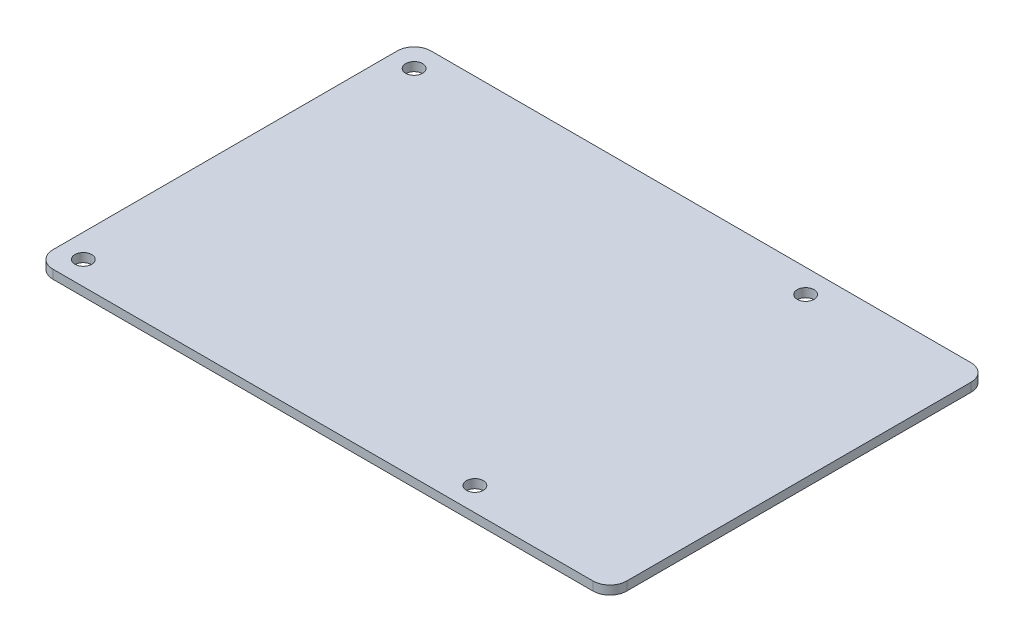
ISO-10303-21;
HEADER;
FILE_DESCRIPTION(('STEP AP214'),'2;1');
FILE_NAME('part.step','',(''),(''),'','','');
FILE_SCHEMA(('AUTOMOTIVE_DESIGN { 1 0 10303 214 1 1 1 1 }'));
ENDSEC;
DATA;
#1=APPLICATION_CONTEXT('core data for automotive mechanical design processes');
#2=APPLICATION_PROTOCOL_DEFINITION('international standard','automotive_design',2000,#1);
#3=PRODUCT_CONTEXT('',#1,'mechanical');
#4=PRODUCT('Part','Part','',(#3));
#5=PRODUCT_RELATED_PRODUCT_CATEGORY('part','',(#4));
#6=PRODUCT_DEFINITION_FORMATION('','',#4);
#7=PRODUCT_DEFINITION_CONTEXT('part definition',#1,'design');
#8=PRODUCT_DEFINITION('design','',#6,#7);
#9=PRODUCT_DEFINITION_SHAPE('','',#8);
#10=(LENGTH_UNIT() NAMED_UNIT(*) SI_UNIT(.MILLI.,.METRE.));
#11=(NAMED_UNIT(*) PLANE_ANGLE_UNIT() SI_UNIT($,.RADIAN.));
#12=(NAMED_UNIT(*) SI_UNIT($,.STERADIAN.) SOLID_ANGLE_UNIT());
#13=UNCERTAINTY_MEASURE_WITH_UNIT(LENGTH_MEASURE(1.E-05),#10,'distance_accuracy_value','');
#14=(GEOMETRIC_REPRESENTATION_CONTEXT(3) GLOBAL_UNCERTAINTY_ASSIGNED_CONTEXT((#13)) GLOBAL_UNIT_ASSIGNED_CONTEXT((#10,
#11,#12)) REPRESENTATION_CONTEXT('',''));
#15=CARTESIAN_POINT('',(0.,0.,0.));
#16=DIRECTION('',(0.,0.,1.));
#17=DIRECTION('',(1.,0.,0.));
#18=AXIS2_PLACEMENT_3D('',#15,#16,#17);
#19=CARTESIAN_POINT('',(39.9999999999725,0.,25.5000000000432));
#20=DIRECTION('',(0.,1.,0.));
#21=DIRECTION('',(0.,0.,1.));
#22=AXIS2_PLACEMENT_3D('',#19,#20,#21);
#23=PLANE('',#22);
#24=CARTESIAN_POINT('',(-40.0000000000275,0.,25.4999999999568));
#25=DIRECTION('',(0.,1.,0.));
#26=DIRECTION('',(0.,0.,1.));
#27=AXIS2_PLACEMENT_3D('',#24,#25,#26);
#28=CIRCLE('',#27,2.50000000000001);
#29=CARTESIAN_POINT('',(-40.0000000000302,0.,27.9999999999568));
#30=VERTEX_POINT('',#29);
#31=CARTESIAN_POINT('',(-42.5000000000275,0.,25.4999999999541));
#32=VERTEX_POINT('',#31);
#33=EDGE_CURVE('E144',#30,#32,#28,.F.);
#34=ORIENTED_EDGE('',*,*,#33,.F.);
#35=DIRECTION('',(1.,0.,1.07938831483967E-12));
#36=VECTOR('',#35,1.);
#37=CARTESIAN_POINT('',(-40.0000000000302,0.,27.9999999999568));
#38=LINE('',#37,#36);
#39=CARTESIAN_POINT('',(39.9999999999711,0.,28.0000000000432));
#40=VERTEX_POINT('',#39);
#41=EDGE_CURVE('E112',#40,#30,#38,.F.);
#42=ORIENTED_EDGE('',*,*,#41,.F.);
#43=CARTESIAN_POINT('',(39.9999999999725,0.,25.5000000000432));
#44=DIRECTION('',(0.,1.,0.));
#45=DIRECTION('',(0.,0.,1.));
#46=AXIS2_PLACEMENT_3D('',#43,#44,#45);
#47=CIRCLE('',#46,2.50000000000001);
#48=CARTESIAN_POINT('',(42.4999999999725,0.,25.5000000000459));
#49=VERTEX_POINT('',#48);
#50=EDGE_CURVE('E98',#49,#40,#47,.F.);
#51=ORIENTED_EDGE('',*,*,#50,.F.);
#52=DIRECTION('',(1.07920208717239E-12,0.,-1.));
#53=VECTOR('',#52,1.);
#54=CARTESIAN_POINT('',(42.4999999999725,0.,25.5000000000459));
#55=LINE('',#54,#53);
#56=CARTESIAN_POINT('',(42.5000000000275,0.,-25.4999999999541));
#57=VERTEX_POINT('',#56);
#58=EDGE_CURVE('E92',#57,#49,#55,.F.);
#59=ORIENTED_EDGE('',*,*,#58,.F.);
#60=CARTESIAN_POINT('',(40.0000000000275,0.,-25.4999999999568));
#61=DIRECTION('',(0.,1.,0.));
#62=DIRECTION('',(0.,0.,1.));
#63=AXIS2_PLACEMENT_3D('',#60,#61,#62);
#64=CIRCLE('',#63,2.5);
#65=CARTESIAN_POINT('',(40.0000000000302,0.,-27.9999999999568));
#66=VERTEX_POINT('',#65);
#67=EDGE_CURVE('E83',#66,#57,#64,.F.);
#68=ORIENTED_EDGE('',*,*,#67,.F.);
#69=DIRECTION('',(-1.,0.,-1.07908473823137E-12));
#70=VECTOR('',#69,1.);
#71=CARTESIAN_POINT('',(40.0000000000302,0.,-27.9999999999568));
#72=LINE('',#71,#70);
#73=CARTESIAN_POINT('',(-39.9999999999698,0.,-28.0000000000432));
#74=VERTEX_POINT('',#73);
#75=EDGE_CURVE('E78',#74,#66,#72,.F.);
#76=ORIENTED_EDGE('',*,*,#75,.F.);
#77=CARTESIAN_POINT('',(-39.9999999999725,0.,-25.5000000000431));
#78=DIRECTION('',(0.,1.,0.));
#79=DIRECTION('',(0.,0.,1.));
#80=AXIS2_PLACEMENT_3D('',#77,#78,#79);
#81=CIRCLE('',#80,2.5);
#82=CARTESIAN_POINT('',(-42.4999999999725,0.,-25.5000000000458));
#83=VERTEX_POINT('',#82);
#84=EDGE_CURVE('E146',#83,#74,#81,.F.);
#85=ORIENTED_EDGE('',*,*,#84,.F.);
#86=DIRECTION('',(-1.07933814391561E-12,0.,1.));
#87=VECTOR('',#86,1.);
#88=CARTESIAN_POINT('',(-42.4999999999725,0.,-25.5000000000458));
#89=LINE('',#88,#87);
#90=EDGE_CURVE('E116',#32,#83,#89,.F.);
#91=ORIENTED_EDGE('',*,*,#90,.F.);
#92=EDGE_LOOP('',(#34,#42,#51,#59,#68,#76,#85,#91));
#93=FACE_BOUND('',#92,.T.);
#94=CARTESIAN_POINT('',(19.000000000013,0.,-24.499999999993));
#95=DIRECTION('',(0.,1.,0.));
#96=DIRECTION('',(0.,0.,1.));
#97=AXIS2_PLACEMENT_3D('',#94,#95,#96);
#98=CIRCLE('',#97,1.24999999998654);
#99=CARTESIAN_POINT('',(19.000000000013,0.,-23.2500000000065));
#100=VERTEX_POINT('',#99);
#101=EDGE_CURVE('E102',#100,#100,#98,.F.);
#102=ORIENTED_EDGE('',*,*,#101,.T.);
#103=EDGE_LOOP('',(#102));
#104=FACE_BOUND('',#103,.T.);
#105=CARTESIAN_POINT('',(-38.999999999987,0.,-24.5000000000555));
#106=DIRECTION('',(0.,1.,0.));
#107=DIRECTION('',(0.,0.,1.));
#108=AXIS2_PLACEMENT_3D('',#105,#106,#107);
#109=CIRCLE('',#108,1.24999999998659);
#110=CARTESIAN_POINT('',(-38.999999999987,0.,-23.250000000069));
#111=VERTEX_POINT('',#110);
#112=EDGE_CURVE('E150',#111,#111,#109,.F.);
#113=ORIENTED_EDGE('',*,*,#112,.T.);
#114=EDGE_LOOP('',(#113));
#115=FACE_BOUND('',#114,.T.);
#116=CARTESIAN_POINT('',(-39.0000000000399,0.,24.4999999999304));
#117=DIRECTION('',(0.,1.,0.));
#118=DIRECTION('',(0.,0.,1.));
#119=AXIS2_PLACEMENT_3D('',#116,#117,#118);
#120=CIRCLE('',#119,1.24999999998655);
#121=CARTESIAN_POINT('',(-39.0000000000399,0.,25.7499999999169));
#122=VERTEX_POINT('',#121);
#123=EDGE_CURVE('E152',#122,#122,#120,.F.);
#124=ORIENTED_EDGE('',*,*,#123,.T.);
#125=EDGE_LOOP('',(#124));
#126=FACE_BOUND('',#125,.T.);
#127=CARTESIAN_POINT('',(18.9999999999601,0.,24.499999999993));
#128=DIRECTION('',(0.,1.,0.));
#129=DIRECTION('',(0.,0.,1.));
#130=AXIS2_PLACEMENT_3D('',#127,#128,#129);
#131=CIRCLE('',#130,1.24999999998654);
#132=CARTESIAN_POINT('',(18.9999999999601,0.,25.7499999999795));
#133=VERTEX_POINT('',#132);
#134=EDGE_CURVE('E20',#133,#133,#131,.F.);
#135=ORIENTED_EDGE('',*,*,#134,.T.);
#136=EDGE_LOOP('',(#135));
#137=FACE_BOUND('',#136,.T.);
#138=ADVANCED_FACE('F17',(#93,#104,#115,#126,#137),#23,.T.);
#139=CARTESIAN_POINT('',(18.9999999999601,-1.3,24.499999999993));
#140=DIRECTION('',(0.,1.,0.));
#141=DIRECTION('',(0.,0.,1.));
#142=AXIS2_PLACEMENT_3D('',#139,#140,#141);
#143=CYLINDRICAL_SURFACE('',#142,1.24999999998654);
#144=CARTESIAN_POINT('',(18.9999999999601,-1.3,24.499999999993));
#145=DIRECTION('',(0.,1.,0.));
#146=DIRECTION('',(0.,0.,1.));
#147=AXIS2_PLACEMENT_3D('',#144,#145,#146);
#148=CIRCLE('',#147,1.24999999998654);
#149=CARTESIAN_POINT('',(18.9999999999601,-1.3,25.7499999999795));
#150=VERTEX_POINT('',#149);
#151=EDGE_CURVE('E139',#150,#150,#148,.F.);
#152=ORIENTED_EDGE('',*,*,#151,.T.);
#153=EDGE_LOOP('',(#152));
#154=FACE_BOUND('',#153,.T.);
#155=ORIENTED_EDGE('',*,*,#134,.F.);
#156=EDGE_LOOP('',(#155));
#157=FACE_BOUND('',#156,.T.);
#158=ADVANCED_FACE('F160',(#154,#157),#143,.F.);
#159=CARTESIAN_POINT('',(-39.0000000000399,-1.3,24.4999999999304));
#160=DIRECTION('',(0.,1.,0.));
#161=DIRECTION('',(0.,0.,1.));
#162=AXIS2_PLACEMENT_3D('',#159,#160,#161);
#163=CYLINDRICAL_SURFACE('',#162,1.24999999998655);
#164=CARTESIAN_POINT('',(-39.0000000000399,-1.3,24.4999999999304));
#165=DIRECTION('',(0.,1.,0.));
#166=DIRECTION('',(0.,0.,1.));
#167=AXIS2_PLACEMENT_3D('',#164,#165,#166);
#168=CIRCLE('',#167,1.24999999998655);
#169=CARTESIAN_POINT('',(-39.0000000000399,-1.3,25.7499999999169));
#170=VERTEX_POINT('',#169);
#171=EDGE_CURVE('E136',#170,#170,#168,.F.);
#172=ORIENTED_EDGE('',*,*,#171,.T.);
#173=EDGE_LOOP('',(#172));
#174=FACE_BOUND('',#173,.T.);
#175=ORIENTED_EDGE('',*,*,#123,.F.);
#176=EDGE_LOOP('',(#175));
#177=FACE_BOUND('',#176,.T.);
#178=ADVANCED_FACE('F162',(#174,#177),#163,.F.);
#179=CARTESIAN_POINT('',(-38.999999999987,-1.3,-24.5000000000555));
#180=DIRECTION('',(0.,1.,0.));
#181=DIRECTION('',(0.,0.,1.));
#182=AXIS2_PLACEMENT_3D('',#179,#180,#181);
#183=CYLINDRICAL_SURFACE('',#182,1.24999999998659);
#184=CARTESIAN_POINT('',(-38.999999999987,-1.3,-24.5000000000555));
#185=DIRECTION('',(0.,1.,0.));
#186=DIRECTION('',(0.,0.,1.));
#187=AXIS2_PLACEMENT_3D('',#184,#185,#186);
#188=CIRCLE('',#187,1.24999999998659);
#189=CARTESIAN_POINT('',(-38.999999999987,-1.3,-23.250000000069));
#190=VERTEX_POINT('',#189);
#191=EDGE_CURVE('E133',#190,#190,#188,.F.);
#192=ORIENTED_EDGE('',*,*,#191,.T.);
#193=EDGE_LOOP('',(#192));
#194=FACE_BOUND('',#193,.T.);
#195=ORIENTED_EDGE('',*,*,#112,.F.);
#196=EDGE_LOOP('',(#195));
#197=FACE_BOUND('',#196,.T.);
#198=ADVANCED_FACE('F169',(#194,#197),#183,.F.);
#199=CARTESIAN_POINT('',(19.000000000013,-1.3,-24.499999999993));
#200=DIRECTION('',(0.,1.,0.));
#201=DIRECTION('',(0.,0.,1.));
#202=AXIS2_PLACEMENT_3D('',#199,#200,#201);
#203=CYLINDRICAL_SURFACE('',#202,1.24999999998654);
#204=CARTESIAN_POINT('',(19.000000000013,-1.3,-24.499999999993));
#205=DIRECTION('',(0.,1.,0.));
#206=DIRECTION('',(0.,0.,1.));
#207=AXIS2_PLACEMENT_3D('',#204,#205,#206);
#208=CIRCLE('',#207,1.24999999998654);
#209=CARTESIAN_POINT('',(19.000000000013,-1.3,-23.2500000000065));
#210=VERTEX_POINT('',#209);
#211=EDGE_CURVE('E130',#210,#210,#208,.F.);
#212=ORIENTED_EDGE('',*,*,#211,.T.);
#213=EDGE_LOOP('',(#212));
#214=FACE_BOUND('',#213,.T.);
#215=ORIENTED_EDGE('',*,*,#101,.F.);
#216=EDGE_LOOP('',(#215));
#217=FACE_BOUND('',#216,.T.);
#218=ADVANCED_FACE('F207',(#214,#217),#203,.F.);
#219=CARTESIAN_POINT('',(42.4999999999725,-1.3,25.5000000000459));
#220=DIRECTION('',(1.,0.,1.07920208717239E-12));
#221=DIRECTION('',(1.07920208717239E-12,0.,-1.));
#222=AXIS2_PLACEMENT_3D('',#219,#220,#221);
#223=PLANE('',#222);
#224=DIRECTION('',(0.,0.,1.));
#225=VECTOR('',#224,1.);
#226=CARTESIAN_POINT('',(42.4999999999725,-1.3,25.5000000000432));
#227=LINE('',#226,#225);
#228=CARTESIAN_POINT('',(42.4999999999725,-1.3,25.5000000000445));
#229=VERTEX_POINT('',#228);
#230=CARTESIAN_POINT('',(42.5,-1.3,-25.4999999999555));
#231=VERTEX_POINT('',#230);
#232=EDGE_CURVE('E106',#229,#231,#227,.F.);
#233=ORIENTED_EDGE('',*,*,#232,.T.);
#234=DIRECTION('',(0.,1.,0.));
#235=VECTOR('',#234,1.);
#236=CARTESIAN_POINT('',(42.5000000000275,-1.3,-25.4999999999541));
#237=LINE('',#236,#235);
#238=EDGE_CURVE('E88',#57,#231,#237,.F.);
#239=ORIENTED_EDGE('',*,*,#238,.F.);
#240=ORIENTED_EDGE('',*,*,#58,.T.);
#241=DIRECTION('',(0.,1.,0.));
#242=VECTOR('',#241,1.);
#243=CARTESIAN_POINT('',(42.4999999999725,-1.3,25.5000000000459));
#244=LINE('',#243,#242);
#245=EDGE_CURVE('E142',#229,#49,#244,.T.);
#246=ORIENTED_EDGE('',*,*,#245,.F.);
#247=EDGE_LOOP('',(#233,#239,#240,#246));
#248=FACE_BOUND('',#247,.T.);
#249=ADVANCED_FACE('F105',(#248),#223,.T.);
#250=CARTESIAN_POINT('',(40.0000000000275,-1.3,-25.4999999999568));
#251=DIRECTION('',(0.,1.,0.));
#252=DIRECTION('',(0.,0.,1.));
#253=AXIS2_PLACEMENT_3D('',#250,#251,#252);
#254=CYLINDRICAL_SURFACE('',#253,2.5);
#255=CARTESIAN_POINT('',(40.0000000000275,-1.3,-25.4999999999568));
#256=DIRECTION('',(0.,1.,0.));
#257=DIRECTION('',(0.,0.,1.));
#258=AXIS2_PLACEMENT_3D('',#255,#256,#257);
#259=CIRCLE('',#258,2.5);
#260=CARTESIAN_POINT('',(40.0000000000289,-1.3,-27.9999999999568));
#261=VERTEX_POINT('',#260);
#262=EDGE_CURVE('E128',#231,#261,#259,.T.);
#263=ORIENTED_EDGE('',*,*,#262,.T.);
#264=DIRECTION('',(0.,1.,0.));
#265=VECTOR('',#264,1.);
#266=CARTESIAN_POINT('',(40.0000000000302,-1.3,-27.9999999999568));
#267=LINE('',#266,#265);
#268=EDGE_CURVE('E90',#66,#261,#267,.F.);
#269=ORIENTED_EDGE('',*,*,#268,.F.);
#270=ORIENTED_EDGE('',*,*,#67,.T.);
#271=ORIENTED_EDGE('',*,*,#238,.T.);
#272=EDGE_LOOP('',(#263,#269,#270,#271));
#273=FACE_BOUND('',#272,.T.);
#274=ADVANCED_FACE('F86',(#273),#254,.T.);
#275=CARTESIAN_POINT('',(40.0000000000302,-1.3,-27.9999999999568));
#276=DIRECTION('',(1.07908473823137E-12,0.,-1.));
#277=DIRECTION('',(-1.,0.,-1.07908473823137E-12));
#278=AXIS2_PLACEMENT_3D('',#275,#276,#277);
#279=PLANE('',#278);
#280=DIRECTION('',(1.,0.,0.));
#281=VECTOR('',#280,1.);
#282=CARTESIAN_POINT('',(39.9999999999725,-1.3,-27.9999999999568));
#283=LINE('',#282,#281);
#284=CARTESIAN_POINT('',(-39.9999999999711,-1.3,-28.));
#285=VERTEX_POINT('',#284);
#286=EDGE_CURVE('E127',#261,#285,#283,.F.);
#287=ORIENTED_EDGE('',*,*,#286,.T.);
#288=DIRECTION('',(0.,1.,0.));
#289=VECTOR('',#288,1.);
#290=CARTESIAN_POINT('',(-39.9999999999698,-1.3,-28.0000000000432));
#291=LINE('',#290,#289);
#292=EDGE_CURVE('E118',#74,#285,#291,.F.);
#293=ORIENTED_EDGE('',*,*,#292,.F.);
#294=ORIENTED_EDGE('',*,*,#75,.T.);
#295=ORIENTED_EDGE('',*,*,#268,.T.);
#296=EDGE_LOOP('',(#287,#293,#294,#295));
#297=FACE_BOUND('',#296,.T.);
#298=ADVANCED_FACE('F199',(#297),#279,.T.);
#299=CARTESIAN_POINT('',(-39.9999999999725,-1.3,-25.5000000000431));
#300=DIRECTION('',(0.,1.,0.));
#301=DIRECTION('',(0.,0.,1.));
#302=AXIS2_PLACEMENT_3D('',#299,#300,#301);
#303=CYLINDRICAL_SURFACE('',#302,2.5);
#304=CARTESIAN_POINT('',(-39.9999999999725,-1.3,-25.5000000000431));
#305=DIRECTION('',(0.,1.,0.));
#306=DIRECTION('',(0.,0.,1.));
#307=AXIS2_PLACEMENT_3D('',#304,#305,#306);
#308=CIRCLE('',#307,2.5);
#309=CARTESIAN_POINT('',(-42.4999999999725,-1.3,-25.5000000000445));
#310=VERTEX_POINT('',#309);
#311=EDGE_CURVE('E124',#285,#310,#308,.T.);
#312=ORIENTED_EDGE('',*,*,#311,.T.);
#313=DIRECTION('',(0.,1.,0.));
#314=VECTOR('',#313,1.);
#315=CARTESIAN_POINT('',(-42.4999999999725,-1.3,-25.5000000000458));
#316=LINE('',#315,#314);
#317=EDGE_CURVE('E117',#83,#310,#316,.F.);
#318=ORIENTED_EDGE('',*,*,#317,.F.);
#319=ORIENTED_EDGE('',*,*,#84,.T.);
#320=ORIENTED_EDGE('',*,*,#292,.T.);
#321=EDGE_LOOP('',(#312,#318,#319,#320));
#322=FACE_BOUND('',#321,.T.);
#323=ADVANCED_FACE('F195',(#322),#303,.T.);
#324=CARTESIAN_POINT('',(-42.4999999999725,-1.3,-25.5000000000458));
#325=DIRECTION('',(-1.,0.,-1.07933814391561E-12));
#326=DIRECTION('',(-1.07933814391561E-12,0.,1.));
#327=AXIS2_PLACEMENT_3D('',#324,#325,#326);
#328=PLANE('',#327);
#329=DIRECTION('',(0.,0.,1.));
#330=VECTOR('',#329,1.);
#331=CARTESIAN_POINT('',(-42.4999999999725,-1.3,25.5000000000432));
#332=LINE('',#331,#330);
#333=CARTESIAN_POINT('',(-42.5,-1.3,25.4999999999555));
#334=VERTEX_POINT('',#333);
#335=EDGE_CURVE('E123',#310,#334,#332,.T.);
#336=ORIENTED_EDGE('',*,*,#335,.T.);
#337=DIRECTION('',(0.,1.,0.));
#338=VECTOR('',#337,1.);
#339=CARTESIAN_POINT('',(-42.5000000000275,-1.3,25.4999999999541));
#340=LINE('',#339,#338);
#341=EDGE_CURVE('E115',#32,#334,#340,.F.);
#342=ORIENTED_EDGE('',*,*,#341,.F.);
#343=ORIENTED_EDGE('',*,*,#90,.T.);
#344=ORIENTED_EDGE('',*,*,#317,.T.);
#345=EDGE_LOOP('',(#336,#342,#343,#344));
#346=FACE_BOUND('',#345,.T.);
#347=ADVANCED_FACE('F191',(#346),#328,.T.);
#348=CARTESIAN_POINT('',(-40.0000000000275,-1.3,25.4999999999568));
#349=DIRECTION('',(0.,1.,0.));
#350=DIRECTION('',(0.,0.,1.));
#351=AXIS2_PLACEMENT_3D('',#348,#349,#350);
#352=CYLINDRICAL_SURFACE('',#351,2.50000000000001);
#353=CARTESIAN_POINT('',(-40.0000000000275,-1.3,25.4999999999568));
#354=DIRECTION('',(0.,1.,0.));
#355=DIRECTION('',(0.,0.,1.));
#356=AXIS2_PLACEMENT_3D('',#353,#354,#355);
#357=CIRCLE('',#356,2.50000000000001);
#358=CARTESIAN_POINT('',(-40.0000000000289,-1.3,27.9999999999568));
#359=VERTEX_POINT('',#358);
#360=EDGE_CURVE('E120',#334,#359,#357,.T.);
#361=ORIENTED_EDGE('',*,*,#360,.T.);
#362=DIRECTION('',(0.,1.,0.));
#363=VECTOR('',#362,1.);
#364=CARTESIAN_POINT('',(-40.0000000000302,-1.3,27.9999999999568));
#365=LINE('',#364,#363);
#366=EDGE_CURVE('E114',#30,#359,#365,.F.);
#367=ORIENTED_EDGE('',*,*,#366,.F.);
#368=ORIENTED_EDGE('',*,*,#33,.T.);
#369=ORIENTED_EDGE('',*,*,#341,.T.);
#370=EDGE_LOOP('',(#361,#367,#368,#369));
#371=FACE_BOUND('',#370,.T.);
#372=ADVANCED_FACE('F187',(#371),#352,.T.);
#373=CARTESIAN_POINT('',(-40.0000000000302,-1.3,27.9999999999568));
#374=DIRECTION('',(-1.07938831483967E-12,0.,1.));
#375=DIRECTION('',(1.,0.,1.07938831483967E-12));
#376=AXIS2_PLACEMENT_3D('',#373,#374,#375);
#377=PLANE('',#376);
#378=DIRECTION('',(1.,0.,0.));
#379=VECTOR('',#378,1.);
#380=CARTESIAN_POINT('',(39.9999999999725,-1.3,27.9999999999568));
#381=LINE('',#380,#379);
#382=CARTESIAN_POINT('',(39.9999999999725,-1.3,28.));
#383=VERTEX_POINT('',#382);
#384=EDGE_CURVE('E26',#359,#383,#381,.T.);
#385=ORIENTED_EDGE('',*,*,#384,.T.);
#386=DIRECTION('',(0.,1.,0.));
#387=VECTOR('',#386,1.);
#388=CARTESIAN_POINT('',(39.9999999999725,-1.3,28.0000000000432));
#389=LINE('',#388,#387);
#390=EDGE_CURVE('E34',#40,#383,#389,.F.);
#391=ORIENTED_EDGE('',*,*,#390,.F.);
#392=ORIENTED_EDGE('',*,*,#41,.T.);
#393=ORIENTED_EDGE('',*,*,#366,.T.);
#394=EDGE_LOOP('',(#385,#391,#392,#393));
#395=FACE_BOUND('',#394,.T.);
#396=ADVANCED_FACE('F180',(#395),#377,.T.);
#397=CARTESIAN_POINT('',(39.9999999999725,-1.3,25.5000000000432));
#398=DIRECTION('',(0.,1.,0.));
#399=DIRECTION('',(0.,0.,1.));
#400=AXIS2_PLACEMENT_3D('',#397,#398,#399);
#401=CYLINDRICAL_SURFACE('',#400,2.50000000000001);
#402=CARTESIAN_POINT('',(39.9999999999725,-1.3,25.5000000000432));
#403=DIRECTION('',(0.,1.,0.));
#404=DIRECTION('',(0.,0.,1.));
#405=AXIS2_PLACEMENT_3D('',#402,#403,#404);
#406=CIRCLE('',#405,2.50000000000001);
#407=EDGE_CURVE('E11',#383,#229,#406,.T.);
#408=ORIENTED_EDGE('',*,*,#407,.T.);
#409=ORIENTED_EDGE('',*,*,#245,.T.);
#410=ORIENTED_EDGE('',*,*,#50,.T.);
#411=ORIENTED_EDGE('',*,*,#390,.T.);
#412=EDGE_LOOP('',(#408,#409,#410,#411));
#413=FACE_BOUND('',#412,.T.);
#414=ADVANCED_FACE('F174',(#413),#401,.T.);
#415=CARTESIAN_POINT('',(39.9999999999725,-1.3,25.5000000000432));
#416=DIRECTION('',(0.,1.,0.));
#417=DIRECTION('',(0.,0.,1.));
#418=AXIS2_PLACEMENT_3D('',#415,#416,#417);
#419=PLANE('',#418);
#420=ORIENTED_EDGE('',*,*,#384,.F.);
#421=ORIENTED_EDGE('',*,*,#360,.F.);
#422=ORIENTED_EDGE('',*,*,#335,.F.);
#423=ORIENTED_EDGE('',*,*,#311,.F.);
#424=ORIENTED_EDGE('',*,*,#286,.F.);
#425=ORIENTED_EDGE('',*,*,#262,.F.);
#426=ORIENTED_EDGE('',*,*,#232,.F.);
#427=ORIENTED_EDGE('',*,*,#407,.F.);
#428=EDGE_LOOP('',(#420,#421,#422,#423,#424,#425,#426,#427));
#429=FACE_BOUND('',#428,.T.);
#430=ORIENTED_EDGE('',*,*,#211,.F.);
#431=EDGE_LOOP('',(#430));
#432=FACE_BOUND('',#431,.T.);
#433=ORIENTED_EDGE('',*,*,#191,.F.);
#434=EDGE_LOOP('',(#433));
#435=FACE_BOUND('',#434,.T.);
#436=ORIENTED_EDGE('',*,*,#171,.F.);
#437=EDGE_LOOP('',(#436));
#438=FACE_BOUND('',#437,.T.);
#439=ORIENTED_EDGE('',*,*,#151,.F.);
#440=EDGE_LOOP('',(#439));
#441=FACE_BOUND('',#440,.T.);
#442=ADVANCED_FACE('F172',(#429,#432,#435,#438,#441),#419,.F.);
#443=CLOSED_SHELL('',(#138,#158,#178,#198,#218,#249,#274,#298,#323,#347,#372,#396,#414,#442));
#444=MANIFOLD_SOLID_BREP('B1',#443);
#445=ADVANCED_BREP_SHAPE_REPRESENTATION('',(#18,#444),#14);
#446=SHAPE_DEFINITION_REPRESENTATION(#9,#445);
ENDSEC;
END-ISO-10303-21;
